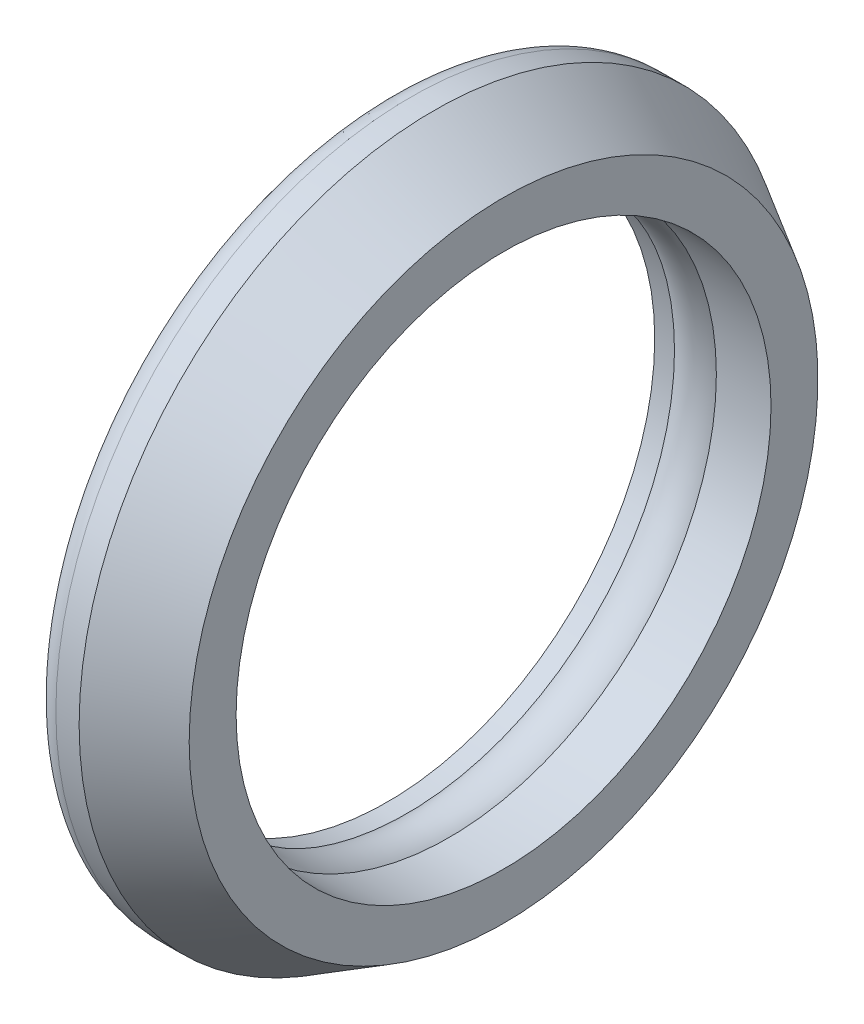
ISO-10303-21;
HEADER;
FILE_DESCRIPTION(('STEP AP214'),'2;1');
FILE_NAME('part.step','',(''),(''),'','','');
FILE_SCHEMA(('AUTOMOTIVE_DESIGN { 1 0 10303 214 1 1 1 1 }'));
ENDSEC;
DATA;
#1=APPLICATION_CONTEXT('core data for automotive mechanical design processes');
#2=APPLICATION_PROTOCOL_DEFINITION('international standard','automotive_design',2000,#1);
#3=PRODUCT_CONTEXT('',#1,'mechanical');
#4=PRODUCT('Part','Part','',(#3));
#5=PRODUCT_RELATED_PRODUCT_CATEGORY('part','',(#4));
#6=PRODUCT_DEFINITION_FORMATION('','',#4);
#7=PRODUCT_DEFINITION_CONTEXT('part definition',#1,'design');
#8=PRODUCT_DEFINITION('design','',#6,#7);
#9=PRODUCT_DEFINITION_SHAPE('','',#8);
#10=(LENGTH_UNIT() NAMED_UNIT(*) SI_UNIT(.MILLI.,.METRE.));
#11=(NAMED_UNIT(*) PLANE_ANGLE_UNIT() SI_UNIT($,.RADIAN.));
#12=(NAMED_UNIT(*) SI_UNIT($,.STERADIAN.) SOLID_ANGLE_UNIT());
#13=UNCERTAINTY_MEASURE_WITH_UNIT(LENGTH_MEASURE(1.E-05),#10,'distance_accuracy_value','');
#14=(GEOMETRIC_REPRESENTATION_CONTEXT(3) GLOBAL_UNCERTAINTY_ASSIGNED_CONTEXT((#13)) GLOBAL_UNIT_ASSIGNED_CONTEXT((#10,
#11,#12)) REPRESENTATION_CONTEXT('',''));
#15=CARTESIAN_POINT('',(0.,0.,0.));
#16=DIRECTION('',(0.,0.,1.));
#17=DIRECTION('',(1.,0.,0.));
#18=AXIS2_PLACEMENT_3D('',#15,#16,#17);
#19=CARTESIAN_POINT('',(0.,0.,0.));
#20=DIRECTION('',(-1.,0.,0.));
#21=DIRECTION('',(0.,0.,1.));
#22=AXIS2_PLACEMENT_3D('',#19,#20,#21);
#23=CYLINDRICAL_SURFACE('',#22,15.25);
#24=CARTESIAN_POINT('',(1.,0.,0.));
#25=DIRECTION('',(1.,0.,0.));
#26=DIRECTION('',(0.,0.,-1.));
#27=AXIS2_PLACEMENT_3D('',#24,#25,#26);
#28=CIRCLE('',#27,15.25);
#29=CARTESIAN_POINT('',(1.,0.,-15.25));
#30=VERTEX_POINT('',#29);
#31=EDGE_CURVE('E10',#30,#30,#28,.T.);
#32=ORIENTED_EDGE('',*,*,#31,.T.);
#33=EDGE_LOOP('',(#32));
#34=FACE_BOUND('',#33,.T.);
#35=CARTESIAN_POINT('',(2.,0.,0.));
#36=DIRECTION('',(-1.,0.,0.));
#37=DIRECTION('',(0.,0.,1.));
#38=AXIS2_PLACEMENT_3D('',#35,#36,#37);
#39=CIRCLE('',#38,15.25);
#40=CARTESIAN_POINT('',(2.,0.,15.25));
#41=VERTEX_POINT('',#40);
#42=EDGE_CURVE('E63',#41,#41,#39,.T.);
#43=ORIENTED_EDGE('',*,*,#42,.T.);
#44=EDGE_LOOP('',(#43));
#45=FACE_BOUND('',#44,.T.);
#46=ADVANCED_FACE('F34',(#34,#45),#23,.T.);
#47=CARTESIAN_POINT('',(0.,11.5,0.));
#48=DIRECTION('',(1.,0.,0.));
#49=DIRECTION('',(0.,0.,-1.));
#50=AXIS2_PLACEMENT_3D('',#47,#48,#49);
#51=PLANE('',#50);
#52=CARTESIAN_POINT('',(0.,0.,0.));
#53=DIRECTION('',(1.,0.,0.));
#54=DIRECTION('',(0.,0.,-1.));
#55=AXIS2_PLACEMENT_3D('',#52,#53,#54);
#56=CIRCLE('',#55,14.25);
#57=CARTESIAN_POINT('',(0.,0.,-14.25));
#58=VERTEX_POINT('',#57);
#59=EDGE_CURVE('E41',#58,#58,#56,.F.);
#60=ORIENTED_EDGE('',*,*,#59,.T.);
#61=EDGE_LOOP('',(#60));
#62=FACE_BOUND('',#61,.T.);
#63=CARTESIAN_POINT('',(0.,0.,0.));
#64=DIRECTION('',(-1.,0.,0.));
#65=DIRECTION('',(0.,0.,1.));
#66=AXIS2_PLACEMENT_3D('',#63,#64,#65);
#67=CIRCLE('',#66,11.5);
#68=CARTESIAN_POINT('',(0.,0.,11.5));
#69=VERTEX_POINT('',#68);
#70=EDGE_CURVE('E45',#69,#69,#67,.T.);
#71=ORIENTED_EDGE('',*,*,#70,.F.);
#72=EDGE_LOOP('',(#71));
#73=FACE_BOUND('',#72,.T.);
#74=ADVANCED_FACE('F95',(#62,#73),#51,.F.);
#75=CARTESIAN_POINT('',(0.,0.,0.));
#76=DIRECTION('',(-1.,0.,0.));
#77=DIRECTION('',(0.,0.,1.));
#78=AXIS2_PLACEMENT_3D('',#75,#76,#77);
#79=CYLINDRICAL_SURFACE('',#78,11.5);
#80=CARTESIAN_POINT('',(0.849999999999986,0.,0.));
#81=DIRECTION('',(-1.,0.,0.));
#82=DIRECTION('',(0.,0.,1.));
#83=AXIS2_PLACEMENT_3D('',#80,#81,#82);
#84=CIRCLE('',#83,11.5);
#85=CARTESIAN_POINT('',(0.849999999999986,0.,11.5));
#86=VERTEX_POINT('',#85);
#87=EDGE_CURVE('E49',#86,#86,#84,.T.);
#88=ORIENTED_EDGE('',*,*,#87,.F.);
#89=EDGE_LOOP('',(#88));
#90=FACE_BOUND('',#89,.T.);
#91=ORIENTED_EDGE('',*,*,#70,.T.);
#92=EDGE_LOOP('',(#91));
#93=FACE_BOUND('',#92,.T.);
#94=ADVANCED_FACE('F89',(#90,#93),#79,.F.);
#95=CARTESIAN_POINT('',(1.74999999999999,0.,0.));
#96=DIRECTION('',(-1.,0.,0.));
#97=DIRECTION('',(0.,0.,1.));
#98=AXIS2_PLACEMENT_3D('',#95,#96,#97);
#99=TOROIDAL_SURFACE('',#98,12.7,1.5);
#100=CARTESIAN_POINT('',(2.64999999999999,0.,0.));
#101=DIRECTION('',(-1.,0.,0.));
#102=DIRECTION('',(0.,0.,1.));
#103=AXIS2_PLACEMENT_3D('',#100,#101,#102);
#104=CIRCLE('',#103,11.5);
#105=CARTESIAN_POINT('',(2.64999999999999,0.,11.5));
#106=VERTEX_POINT('',#105);
#107=EDGE_CURVE('E54',#106,#106,#104,.T.);
#108=ORIENTED_EDGE('',*,*,#107,.F.);
#109=EDGE_LOOP('',(#108));
#110=FACE_BOUND('',#109,.T.);
#111=ORIENTED_EDGE('',*,*,#87,.T.);
#112=EDGE_LOOP('',(#111));
#113=FACE_BOUND('',#112,.T.);
#114=ADVANCED_FACE('F83',(#110,#113),#99,.T.);
#115=CARTESIAN_POINT('',(0.,0.,0.));
#116=DIRECTION('',(-1.,0.,0.));
#117=DIRECTION('',(0.,0.,1.));
#118=AXIS2_PLACEMENT_3D('',#115,#116,#117);
#119=CYLINDRICAL_SURFACE('',#118,11.5);
#120=CARTESIAN_POINT('',(5.,0.,0.));
#121=DIRECTION('',(-1.,0.,0.));
#122=DIRECTION('',(0.,0.,1.));
#123=AXIS2_PLACEMENT_3D('',#120,#121,#122);
#124=CIRCLE('',#123,11.5);
#125=CARTESIAN_POINT('',(5.,0.,11.5));
#126=VERTEX_POINT('',#125);
#127=EDGE_CURVE('E57',#126,#126,#124,.T.);
#128=ORIENTED_EDGE('',*,*,#127,.F.);
#129=EDGE_LOOP('',(#128));
#130=FACE_BOUND('',#129,.T.);
#131=ORIENTED_EDGE('',*,*,#107,.T.);
#132=EDGE_LOOP('',(#131));
#133=FACE_BOUND('',#132,.T.);
#134=ADVANCED_FACE('F77',(#130,#133),#119,.F.);
#135=CARTESIAN_POINT('',(5.,13.5179491924311,0.));
#136=DIRECTION('',(-1.,0.,0.));
#137=DIRECTION('',(0.,0.,1.));
#138=AXIS2_PLACEMENT_3D('',#135,#136,#137);
#139=PLANE('',#138);
#140=CARTESIAN_POINT('',(5.,0.,0.));
#141=DIRECTION('',(-1.,0.,0.));
#142=DIRECTION('',(0.,0.,1.));
#143=AXIS2_PLACEMENT_3D('',#140,#141,#142);
#144=CIRCLE('',#143,13.5179491924311);
#145=CARTESIAN_POINT('',(5.,0.,13.5179491924311));
#146=VERTEX_POINT('',#145);
#147=EDGE_CURVE('E60',#146,#146,#144,.T.);
#148=ORIENTED_EDGE('',*,*,#147,.F.);
#149=EDGE_LOOP('',(#148));
#150=FACE_BOUND('',#149,.T.);
#151=ORIENTED_EDGE('',*,*,#127,.T.);
#152=EDGE_LOOP('',(#151));
#153=FACE_BOUND('',#152,.T.);
#154=ADVANCED_FACE('F71',(#150,#153),#139,.F.);
#155=CARTESIAN_POINT('',(5.,0.,0.));
#156=DIRECTION('',(-1.,0.,0.));
#157=DIRECTION('',(0.,0.,1.));
#158=AXIS2_PLACEMENT_3D('',#155,#156,#157);
#159=CONICAL_SURFACE('',#158,13.5179491924311,0.523598775598297);
#160=ORIENTED_EDGE('',*,*,#42,.F.);
#161=EDGE_LOOP('',(#160));
#162=FACE_BOUND('',#161,.T.);
#163=ORIENTED_EDGE('',*,*,#147,.T.);
#164=EDGE_LOOP('',(#163));
#165=FACE_BOUND('',#164,.T.);
#166=ADVANCED_FACE('F68',(#162,#165),#159,.T.);
#167=CARTESIAN_POINT('',(1.,0.,0.));
#168=DIRECTION('',(1.,0.,0.));
#169=DIRECTION('',(0.,0.,-1.));
#170=AXIS2_PLACEMENT_3D('',#167,#168,#169);
#171=TOROIDAL_SURFACE('',#170,14.25,1.);
#172=ORIENTED_EDGE('',*,*,#31,.F.);
#173=EDGE_LOOP('',(#172));
#174=FACE_BOUND('',#173,.T.);
#175=ORIENTED_EDGE('',*,*,#59,.F.);
#176=EDGE_LOOP('',(#175));
#177=FACE_BOUND('',#176,.T.);
#178=ADVANCED_FACE('F36',(#174,#177),#171,.T.);
#179=CLOSED_SHELL('',(#46,#74,#94,#114,#134,#154,#166,#178));
#180=MANIFOLD_SOLID_BREP('B2',#179);
#181=ADVANCED_BREP_SHAPE_REPRESENTATION('',(#18,#180),#14);
#182=SHAPE_DEFINITION_REPRESENTATION(#9,#181);
ENDSEC;
END-ISO-10303-21;
